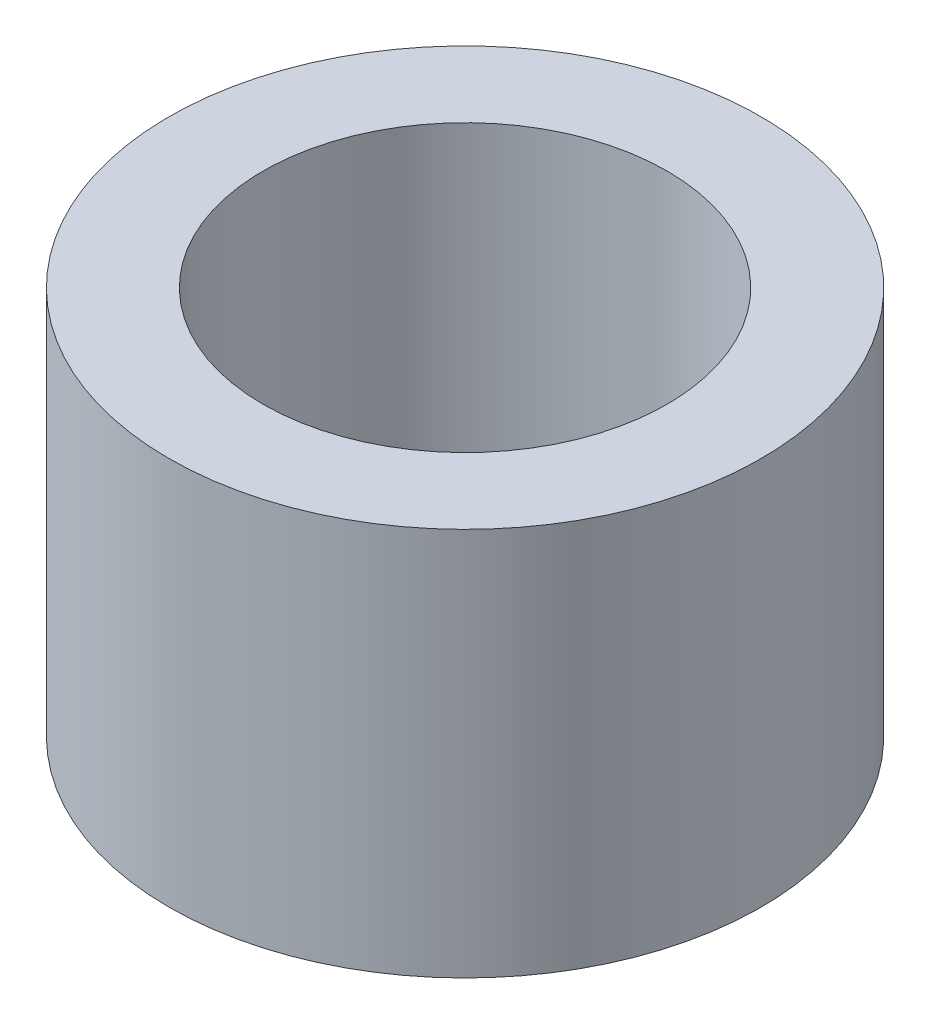
ISO-10303-21;
HEADER;
FILE_DESCRIPTION(('STEP AP214'),'2;1');
FILE_NAME('part.step','',(''),(''),'','','');
FILE_SCHEMA(('AUTOMOTIVE_DESIGN { 1 0 10303 214 1 1 1 1 }'));
ENDSEC;
DATA;
#1=APPLICATION_CONTEXT('core data for automotive mechanical design processes');
#2=APPLICATION_PROTOCOL_DEFINITION('international standard','automotive_design',2000,#1);
#3=PRODUCT_CONTEXT('',#1,'mechanical');
#4=PRODUCT('Part','Part','',(#3));
#5=PRODUCT_RELATED_PRODUCT_CATEGORY('part','',(#4));
#6=PRODUCT_DEFINITION_FORMATION('','',#4);
#7=PRODUCT_DEFINITION_CONTEXT('part definition',#1,'design');
#8=PRODUCT_DEFINITION('design','',#6,#7);
#9=PRODUCT_DEFINITION_SHAPE('','',#8);
#10=(LENGTH_UNIT() NAMED_UNIT(*) SI_UNIT(.MILLI.,.METRE.));
#11=(NAMED_UNIT(*) PLANE_ANGLE_UNIT() SI_UNIT($,.RADIAN.));
#12=(NAMED_UNIT(*) SI_UNIT($,.STERADIAN.) SOLID_ANGLE_UNIT());
#13=UNCERTAINTY_MEASURE_WITH_UNIT(LENGTH_MEASURE(1.E-05),#10,'distance_accuracy_value','');
#14=(GEOMETRIC_REPRESENTATION_CONTEXT(3) GLOBAL_UNCERTAINTY_ASSIGNED_CONTEXT((#13)) GLOBAL_UNIT_ASSIGNED_CONTEXT((#10,
#11,#12)) REPRESENTATION_CONTEXT('',''));
#15=CARTESIAN_POINT('',(0.,0.,0.));
#16=DIRECTION('',(0.,0.,1.));
#17=DIRECTION('',(1.,0.,0.));
#18=AXIS2_PLACEMENT_3D('',#15,#16,#17);
#19=CARTESIAN_POINT('',(0.,5.,0.));
#20=DIRECTION('',(0.,1.,0.));
#21=DIRECTION('',(0.,0.,1.));
#22=AXIS2_PLACEMENT_3D('',#19,#20,#21);
#23=PLANE('',#22);
#24=CARTESIAN_POINT('',(0.,5.,0.));
#25=DIRECTION('',(0.,1.,0.));
#26=DIRECTION('',(0.,0.,1.));
#27=AXIS2_PLACEMENT_3D('',#24,#25,#26);
#28=CIRCLE('',#27,3.81);
#29=CARTESIAN_POINT('',(0.,5.,3.81));
#30=VERTEX_POINT('',#29);
#31=EDGE_CURVE('E10',#30,#30,#28,.T.);
#32=ORIENTED_EDGE('',*,*,#31,.T.);
#33=EDGE_LOOP('',(#32));
#34=FACE_BOUND('',#33,.T.);
#35=CARTESIAN_POINT('',(0.,5.,0.));
#36=DIRECTION('',(0.,1.,0.));
#37=DIRECTION('',(0.,0.,1.));
#38=AXIS2_PLACEMENT_3D('',#35,#36,#37);
#39=CIRCLE('',#38,2.6);
#40=CARTESIAN_POINT('',(0.,5.,2.6));
#41=VERTEX_POINT('',#40);
#42=EDGE_CURVE('E50',#41,#41,#39,.T.);
#43=ORIENTED_EDGE('',*,*,#42,.F.);
#44=EDGE_LOOP('',(#43));
#45=FACE_BOUND('',#44,.T.);
#46=ADVANCED_FACE('F37',(#34,#45),#23,.T.);
#47=CARTESIAN_POINT('',(0.,0.,0.));
#48=DIRECTION('',(0.,1.,0.));
#49=DIRECTION('',(0.,0.,1.));
#50=AXIS2_PLACEMENT_3D('',#47,#48,#49);
#51=PLANE('',#50);
#52=CARTESIAN_POINT('',(0.,0.,0.));
#53=DIRECTION('',(0.,1.,0.));
#54=DIRECTION('',(0.,0.,1.));
#55=AXIS2_PLACEMENT_3D('',#52,#53,#54);
#56=CIRCLE('',#55,3.81);
#57=CARTESIAN_POINT('',(0.,0.,3.81));
#58=VERTEX_POINT('',#57);
#59=EDGE_CURVE('E41',#58,#58,#56,.T.);
#60=ORIENTED_EDGE('',*,*,#59,.F.);
#61=EDGE_LOOP('',(#60));
#62=FACE_BOUND('',#61,.T.);
#63=CARTESIAN_POINT('',(0.,0.,0.));
#64=DIRECTION('',(0.,1.,0.));
#65=DIRECTION('',(0.,0.,1.));
#66=AXIS2_PLACEMENT_3D('',#63,#64,#65);
#67=CIRCLE('',#66,2.6);
#68=CARTESIAN_POINT('',(0.,0.,2.6));
#69=VERTEX_POINT('',#68);
#70=EDGE_CURVE('E52',#69,#69,#67,.T.);
#71=ORIENTED_EDGE('',*,*,#70,.T.);
#72=EDGE_LOOP('',(#71));
#73=FACE_BOUND('',#72,.T.);
#74=ADVANCED_FACE('F64',(#62,#73),#51,.F.);
#75=CARTESIAN_POINT('',(0.,5.,0.));
#76=DIRECTION('',(0.,-1.,0.));
#77=DIRECTION('',(0.,0.,-1.));
#78=AXIS2_PLACEMENT_3D('',#75,#76,#77);
#79=CYLINDRICAL_SURFACE('',#78,3.81);
#80=ORIENTED_EDGE('',*,*,#31,.F.);
#81=EDGE_LOOP('',(#80));
#82=FACE_BOUND('',#81,.T.);
#83=ORIENTED_EDGE('',*,*,#59,.T.);
#84=EDGE_LOOP('',(#83));
#85=FACE_BOUND('',#84,.T.);
#86=ADVANCED_FACE('F39',(#82,#85),#79,.T.);
#87=CARTESIAN_POINT('',(0.,5.,0.));
#88=DIRECTION('',(0.,-1.,0.));
#89=DIRECTION('',(0.,0.,-1.));
#90=AXIS2_PLACEMENT_3D('',#87,#88,#89);
#91=CYLINDRICAL_SURFACE('',#90,2.6);
#92=ORIENTED_EDGE('',*,*,#42,.T.);
#93=EDGE_LOOP('',(#92));
#94=FACE_BOUND('',#93,.T.);
#95=ORIENTED_EDGE('',*,*,#70,.F.);
#96=EDGE_LOOP('',(#95));
#97=FACE_BOUND('',#96,.T.);
#98=ADVANCED_FACE('F60',(#94,#97),#91,.F.);
#99=CLOSED_SHELL('',(#46,#74,#86,#98));
#100=MANIFOLD_SOLID_BREP('B2',#99);
#101=ADVANCED_BREP_SHAPE_REPRESENTATION('',(#18,#100),#14);
#102=SHAPE_DEFINITION_REPRESENTATION(#9,#101);
ENDSEC;
END-ISO-10303-21;
